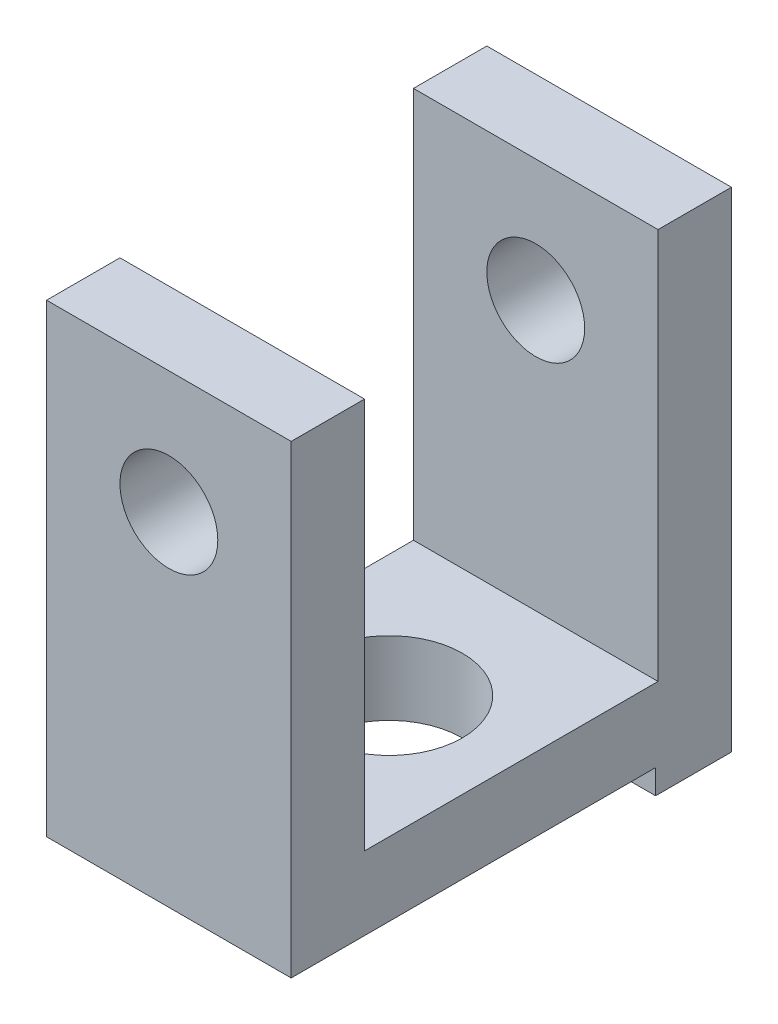
ISO-10303-21;
HEADER;
FILE_DESCRIPTION(('STEP AP214'),'2;1');
FILE_NAME('part.step','',(''),(''),'','','');
FILE_SCHEMA(('AUTOMOTIVE_DESIGN { 1 0 10303 214 1 1 1 1 }'));
ENDSEC;
DATA;
#1=APPLICATION_CONTEXT('core data for automotive mechanical design processes');
#2=APPLICATION_PROTOCOL_DEFINITION('international standard','automotive_design',2000,#1);
#3=PRODUCT_CONTEXT('',#1,'mechanical');
#4=PRODUCT('Part','Part','',(#3));
#5=PRODUCT_RELATED_PRODUCT_CATEGORY('part','',(#4));
#6=PRODUCT_DEFINITION_FORMATION('','',#4);
#7=PRODUCT_DEFINITION_CONTEXT('part definition',#1,'design');
#8=PRODUCT_DEFINITION('design','',#6,#7);
#9=PRODUCT_DEFINITION_SHAPE('','',#8);
#10=(LENGTH_UNIT() NAMED_UNIT(*) SI_UNIT(.MILLI.,.METRE.));
#11=(NAMED_UNIT(*) PLANE_ANGLE_UNIT() SI_UNIT($,.RADIAN.));
#12=(NAMED_UNIT(*) SI_UNIT($,.STERADIAN.) SOLID_ANGLE_UNIT());
#13=UNCERTAINTY_MEASURE_WITH_UNIT(LENGTH_MEASURE(1.E-05),#10,'distance_accuracy_value','');
#14=(GEOMETRIC_REPRESENTATION_CONTEXT(3) GLOBAL_UNCERTAINTY_ASSIGNED_CONTEXT((#13)) GLOBAL_UNIT_ASSIGNED_CONTEXT((#10,
#11,#12)) REPRESENTATION_CONTEXT('',''));
#15=CARTESIAN_POINT('',(0.,0.,0.));
#16=DIRECTION('',(0.,0.,1.));
#17=DIRECTION('',(1.,0.,0.));
#18=AXIS2_PLACEMENT_3D('',#15,#16,#17);
#19=CARTESIAN_POINT('',(0.,4.,9.));
#20=DIRECTION('',(0.,0.,1.));
#21=DIRECTION('',(1.,0.,0.));
#22=AXIS2_PLACEMENT_3D('',#19,#20,#21);
#23=PLANE('',#22);
#24=CARTESIAN_POINT('',(0.,15.,9.));
#25=DIRECTION('',(0.,0.,1.));
#26=DIRECTION('',(1.,0.,0.));
#27=AXIS2_PLACEMENT_3D('',#24,#25,#26);
#28=CIRCLE('',#27,2.);
#29=CARTESIAN_POINT('',(2.,15.,9.));
#30=VERTEX_POINT('',#29);
#31=EDGE_CURVE('E165',#30,#30,#28,.T.);
#32=ORIENTED_EDGE('',*,*,#31,.F.);
#33=EDGE_LOOP('',(#32));
#34=FACE_BOUND('',#33,.T.);
#35=DIRECTION('',(0.,-1.,0.));
#36=VECTOR('',#35,1.);
#37=CARTESIAN_POINT('',(-5.,4.,9.));
#38=LINE('',#37,#36);
#39=CARTESIAN_POINT('',(-5.,20.,9.));
#40=VERTEX_POINT('',#39);
#41=CARTESIAN_POINT('',(-5.,1.,9.));
#42=VERTEX_POINT('',#41);
#43=EDGE_CURVE('E203',#40,#42,#38,.T.);
#44=ORIENTED_EDGE('',*,*,#43,.T.);
#45=DIRECTION('',(-1.,0.,0.));
#46=VECTOR('',#45,1.);
#47=CARTESIAN_POINT('',(-5.,1.,9.));
#48=LINE('',#47,#46);
#49=CARTESIAN_POINT('',(5.,1.,9.));
#50=VERTEX_POINT('',#49);
#51=EDGE_CURVE('E137',#50,#42,#48,.T.);
#52=ORIENTED_EDGE('',*,*,#51,.F.);
#53=DIRECTION('',(0.,-1.,0.));
#54=VECTOR('',#53,1.);
#55=CARTESIAN_POINT('',(5.,4.,9.));
#56=LINE('',#55,#54);
#57=CARTESIAN_POINT('',(5.,20.,9.));
#58=VERTEX_POINT('',#57);
#59=EDGE_CURVE('E136',#58,#50,#56,.T.);
#60=ORIENTED_EDGE('',*,*,#59,.F.);
#61=DIRECTION('',(1.,0.,0.));
#62=VECTOR('',#61,1.);
#63=CARTESIAN_POINT('',(5.,20.,9.));
#64=LINE('',#63,#62);
#65=EDGE_CURVE('E169',#40,#58,#64,.T.);
#66=ORIENTED_EDGE('',*,*,#65,.F.);
#67=EDGE_LOOP('',(#44,#52,#60,#66));
#68=FACE_BOUND('',#67,.T.);
#69=ADVANCED_FACE('F40',(#34,#68),#23,.T.);
#70=CARTESIAN_POINT('',(0.,4.,0.));
#71=DIRECTION('',(0.,-1.,0.));
#72=DIRECTION('',(0.,0.,-1.));
#73=AXIS2_PLACEMENT_3D('',#70,#71,#72);
#74=CYLINDRICAL_SURFACE('',#73,3.);
#75=CARTESIAN_POINT('',(0.,4.,0.));
#76=DIRECTION('',(0.,1.,0.));
#77=DIRECTION('',(0.,0.,1.));
#78=AXIS2_PLACEMENT_3D('',#75,#76,#77);
#79=CIRCLE('',#78,3.);
#80=CARTESIAN_POINT('',(0.,4.,3.));
#81=VERTEX_POINT('',#80);
#82=EDGE_CURVE('E194',#81,#81,#79,.T.);
#83=ORIENTED_EDGE('',*,*,#82,.T.);
#84=EDGE_LOOP('',(#83));
#85=FACE_BOUND('',#84,.T.);
#86=CARTESIAN_POINT('',(0.,1.,0.));
#87=DIRECTION('',(0.,-1.,0.));
#88=DIRECTION('',(0.,0.,-1.));
#89=AXIS2_PLACEMENT_3D('',#86,#87,#88);
#90=CIRCLE('',#89,3.);
#91=CARTESIAN_POINT('',(0.,1.,-3.));
#92=VERTEX_POINT('',#91);
#93=EDGE_CURVE('E44',#92,#92,#90,.T.);
#94=ORIENTED_EDGE('',*,*,#93,.T.);
#95=EDGE_LOOP('',(#94));
#96=FACE_BOUND('',#95,.T.);
#97=ADVANCED_FACE('F252',(#85,#96),#74,.F.);
#98=CARTESIAN_POINT('',(5.,4.,0.));
#99=DIRECTION('',(1.,0.,0.));
#100=DIRECTION('',(0.,0.,-1.));
#101=AXIS2_PLACEMENT_3D('',#98,#99,#100);
#102=PLANE('',#101);
#103=DIRECTION('',(0.,-1.,0.));
#104=VECTOR('',#103,1.);
#105=CARTESIAN_POINT('',(5.,1.,-5.9));
#106=LINE('',#105,#104);
#107=CARTESIAN_POINT('',(5.,1.,-5.9));
#108=VERTEX_POINT('',#107);
#109=CARTESIAN_POINT('',(5.,0.,-5.9));
#110=VERTEX_POINT('',#109);
#111=EDGE_CURVE('E116',#108,#110,#106,.T.);
#112=ORIENTED_EDGE('',*,*,#111,.T.);
#113=DIRECTION('',(0.,0.,1.));
#114=VECTOR('',#113,1.);
#115=CARTESIAN_POINT('',(5.,0.,0.));
#116=LINE('',#115,#114);
#117=CARTESIAN_POINT('',(5.,0.,-9.));
#118=VERTEX_POINT('',#117);
#119=EDGE_CURVE('E188',#118,#110,#116,.T.);
#120=ORIENTED_EDGE('',*,*,#119,.F.);
#121=DIRECTION('',(0.,-1.,0.));
#122=VECTOR('',#121,1.);
#123=CARTESIAN_POINT('',(5.,4.,-9.));
#124=LINE('',#123,#122);
#125=CARTESIAN_POINT('',(5.,20.,-9.));
#126=VERTEX_POINT('',#125);
#127=EDGE_CURVE('E11',#126,#118,#124,.T.);
#128=ORIENTED_EDGE('',*,*,#127,.F.);
#129=DIRECTION('',(0.,0.,1.));
#130=VECTOR('',#129,1.);
#131=CARTESIAN_POINT('',(5.,20.,-6.));
#132=LINE('',#131,#130);
#133=CARTESIAN_POINT('',(5.,20.,-6.));
#134=VERTEX_POINT('',#133);
#135=EDGE_CURVE('E157',#126,#134,#132,.T.);
#136=ORIENTED_EDGE('',*,*,#135,.T.);
#137=DIRECTION('',(0.,-1.,0.));
#138=VECTOR('',#137,1.);
#139=CARTESIAN_POINT('',(5.,20.,-6.));
#140=LINE('',#139,#138);
#141=CARTESIAN_POINT('',(5.,4.,-6.));
#142=VERTEX_POINT('',#141);
#143=EDGE_CURVE('E160',#134,#142,#140,.T.);
#144=ORIENTED_EDGE('',*,*,#143,.T.);
#145=DIRECTION('',(0.,0.,1.));
#146=VECTOR('',#145,1.);
#147=CARTESIAN_POINT('',(5.,4.,0.));
#148=LINE('',#147,#146);
#149=CARTESIAN_POINT('',(5.,4.,6.));
#150=VERTEX_POINT('',#149);
#151=EDGE_CURVE('E189',#142,#150,#148,.T.);
#152=ORIENTED_EDGE('',*,*,#151,.T.);
#153=DIRECTION('',(0.,-1.,0.));
#154=VECTOR('',#153,1.);
#155=CARTESIAN_POINT('',(5.,20.,6.));
#156=LINE('',#155,#154);
#157=CARTESIAN_POINT('',(5.,20.,6.));
#158=VERTEX_POINT('',#157);
#159=EDGE_CURVE('E185',#158,#150,#156,.T.);
#160=ORIENTED_EDGE('',*,*,#159,.F.);
#161=DIRECTION('',(0.,0.,-1.));
#162=VECTOR('',#161,1.);
#163=CARTESIAN_POINT('',(5.,20.,6.));
#164=LINE('',#163,#162);
#165=EDGE_CURVE('E172',#58,#158,#164,.T.);
#166=ORIENTED_EDGE('',*,*,#165,.F.);
#167=ORIENTED_EDGE('',*,*,#59,.T.);
#168=DIRECTION('',(0.,0.,1.));
#169=VECTOR('',#168,1.);
#170=CARTESIAN_POINT('',(5.,1.,-5.9));
#171=LINE('',#170,#169);
#172=EDGE_CURVE('E130',#108,#50,#171,.T.);
#173=ORIENTED_EDGE('',*,*,#172,.F.);
#174=EDGE_LOOP('',(#112,#120,#128,#136,#144,#152,#160,#166,#167,#173));
#175=FACE_BOUND('',#174,.T.);
#176=ADVANCED_FACE('F42',(#175),#102,.T.);
#177=CARTESIAN_POINT('',(0.,4.,-9.));
#178=DIRECTION('',(0.,0.,1.));
#179=DIRECTION('',(1.,0.,0.));
#180=AXIS2_PLACEMENT_3D('',#177,#178,#179);
#181=PLANE('',#180);
#182=CARTESIAN_POINT('',(0.,15.,-9.));
#183=DIRECTION('',(0.,0.,1.));
#184=DIRECTION('',(1.,0.,0.));
#185=AXIS2_PLACEMENT_3D('',#182,#183,#184);
#186=CIRCLE('',#185,2.);
#187=CARTESIAN_POINT('',(2.,15.,-9.));
#188=VERTEX_POINT('',#187);
#189=EDGE_CURVE('E144',#188,#188,#186,.T.);
#190=ORIENTED_EDGE('',*,*,#189,.T.);
#191=EDGE_LOOP('',(#190));
#192=FACE_BOUND('',#191,.T.);
#193=DIRECTION('',(-1.,0.,0.));
#194=VECTOR('',#193,1.);
#195=CARTESIAN_POINT('',(0.,0.,-9.));
#196=LINE('',#195,#194);
#197=CARTESIAN_POINT('',(-5.,0.,-9.));
#198=VERTEX_POINT('',#197);
#199=EDGE_CURVE('E198',#118,#198,#196,.T.);
#200=ORIENTED_EDGE('',*,*,#199,.T.);
#201=DIRECTION('',(0.,-1.,0.));
#202=VECTOR('',#201,1.);
#203=CARTESIAN_POINT('',(-5.,4.,-9.));
#204=LINE('',#203,#202);
#205=CARTESIAN_POINT('',(-5.,20.,-9.));
#206=VERTEX_POINT('',#205);
#207=EDGE_CURVE('E49',#206,#198,#204,.T.);
#208=ORIENTED_EDGE('',*,*,#207,.F.);
#209=DIRECTION('',(1.,0.,0.));
#210=VECTOR('',#209,1.);
#211=CARTESIAN_POINT('',(5.,20.,-9.));
#212=LINE('',#211,#210);
#213=EDGE_CURVE('E148',#206,#126,#212,.T.);
#214=ORIENTED_EDGE('',*,*,#213,.T.);
#215=ORIENTED_EDGE('',*,*,#127,.T.);
#216=EDGE_LOOP('',(#200,#208,#214,#215));
#217=FACE_BOUND('',#216,.T.);
#218=ADVANCED_FACE('F221',(#192,#217),#181,.F.);
#219=CARTESIAN_POINT('',(-5.,4.,0.));
#220=DIRECTION('',(1.,0.,0.));
#221=DIRECTION('',(0.,0.,-1.));
#222=AXIS2_PLACEMENT_3D('',#219,#220,#221);
#223=PLANE('',#222);
#224=DIRECTION('',(0.,0.,1.));
#225=VECTOR('',#224,1.);
#226=CARTESIAN_POINT('',(-5.,0.,0.));
#227=LINE('',#226,#225);
#228=CARTESIAN_POINT('',(-5.,0.,-5.9));
#229=VERTEX_POINT('',#228);
#230=EDGE_CURVE('E192',#198,#229,#227,.T.);
#231=ORIENTED_EDGE('',*,*,#230,.T.);
#232=DIRECTION('',(0.,-1.,0.));
#233=VECTOR('',#232,1.);
#234=CARTESIAN_POINT('',(-5.,1.,-5.9));
#235=LINE('',#234,#233);
#236=CARTESIAN_POINT('',(-5.,1.,-5.9));
#237=VERTEX_POINT('',#236);
#238=EDGE_CURVE('E57',#237,#229,#235,.T.);
#239=ORIENTED_EDGE('',*,*,#238,.F.);
#240=DIRECTION('',(0.,0.,-1.));
#241=VECTOR('',#240,1.);
#242=CARTESIAN_POINT('',(-5.,1.,9.));
#243=LINE('',#242,#241);
#244=EDGE_CURVE('E126',#42,#237,#243,.T.);
#245=ORIENTED_EDGE('',*,*,#244,.F.);
#246=ORIENTED_EDGE('',*,*,#43,.F.);
#247=DIRECTION('',(0.,0.,1.));
#248=VECTOR('',#247,1.);
#249=CARTESIAN_POINT('',(-5.,20.,9.));
#250=LINE('',#249,#248);
#251=CARTESIAN_POINT('',(-5.,20.,6.));
#252=VERTEX_POINT('',#251);
#253=EDGE_CURVE('E177',#252,#40,#250,.T.);
#254=ORIENTED_EDGE('',*,*,#253,.F.);
#255=DIRECTION('',(0.,-1.,0.));
#256=VECTOR('',#255,1.);
#257=CARTESIAN_POINT('',(-5.,20.,6.));
#258=LINE('',#257,#256);
#259=CARTESIAN_POINT('',(-5.,4.,6.));
#260=VERTEX_POINT('',#259);
#261=EDGE_CURVE('E180',#252,#260,#258,.T.);
#262=ORIENTED_EDGE('',*,*,#261,.T.);
#263=DIRECTION('',(0.,0.,1.));
#264=VECTOR('',#263,1.);
#265=CARTESIAN_POINT('',(-5.,4.,0.));
#266=LINE('',#265,#264);
#267=CARTESIAN_POINT('',(-5.,4.,-6.));
#268=VERTEX_POINT('',#267);
#269=EDGE_CURVE('E191',#268,#260,#266,.T.);
#270=ORIENTED_EDGE('',*,*,#269,.F.);
#271=DIRECTION('',(0.,-1.,0.));
#272=VECTOR('',#271,1.);
#273=CARTESIAN_POINT('',(-5.,20.,-6.));
#274=LINE('',#273,#272);
#275=CARTESIAN_POINT('',(-5.,20.,-6.));
#276=VERTEX_POINT('',#275);
#277=EDGE_CURVE('E163',#276,#268,#274,.T.);
#278=ORIENTED_EDGE('',*,*,#277,.F.);
#279=DIRECTION('',(0.,0.,-1.));
#280=VECTOR('',#279,1.);
#281=CARTESIAN_POINT('',(-5.,20.,-9.));
#282=LINE('',#281,#280);
#283=EDGE_CURVE('E151',#276,#206,#282,.T.);
#284=ORIENTED_EDGE('',*,*,#283,.T.);
#285=ORIENTED_EDGE('',*,*,#207,.T.);
#286=EDGE_LOOP('',(#231,#239,#245,#246,#254,#262,#270,#278,#284,#285));
#287=FACE_BOUND('',#286,.T.);
#288=ADVANCED_FACE('F224',(#287),#223,.F.);
#289=CARTESIAN_POINT('',(0.,4.,0.));
#290=DIRECTION('',(0.,1.,0.));
#291=DIRECTION('',(0.,0.,1.));
#292=AXIS2_PLACEMENT_3D('',#289,#290,#291);
#293=PLANE('',#292);
#294=DIRECTION('',(-1.,0.,0.));
#295=VECTOR('',#294,1.);
#296=CARTESIAN_POINT('',(-5.,4.,-6.));
#297=LINE('',#296,#295);
#298=EDGE_CURVE('E65',#142,#268,#297,.T.);
#299=ORIENTED_EDGE('',*,*,#298,.T.);
#300=ORIENTED_EDGE('',*,*,#269,.T.);
#301=DIRECTION('',(-1.,0.,0.));
#302=VECTOR('',#301,1.);
#303=CARTESIAN_POINT('',(-5.,4.,6.));
#304=LINE('',#303,#302);
#305=EDGE_CURVE('E173',#150,#260,#304,.T.);
#306=ORIENTED_EDGE('',*,*,#305,.F.);
#307=ORIENTED_EDGE('',*,*,#151,.F.);
#308=EDGE_LOOP('',(#299,#300,#306,#307));
#309=FACE_BOUND('',#308,.T.);
#310=ORIENTED_EDGE('',*,*,#82,.F.);
#311=EDGE_LOOP('',(#310));
#312=FACE_BOUND('',#311,.T.);
#313=ADVANCED_FACE('F239',(#309,#312),#293,.T.);
#314=CARTESIAN_POINT('',(0.,0.,0.));
#315=DIRECTION('',(0.,1.,0.));
#316=DIRECTION('',(0.,0.,1.));
#317=AXIS2_PLACEMENT_3D('',#314,#315,#316);
#318=PLANE('',#317);
#319=ORIENTED_EDGE('',*,*,#119,.T.);
#320=DIRECTION('',(1.,0.,0.));
#321=VECTOR('',#320,1.);
#322=CARTESIAN_POINT('',(-5.,0.,-5.9));
#323=LINE('',#322,#321);
#324=EDGE_CURVE('E121',#229,#110,#323,.T.);
#325=ORIENTED_EDGE('',*,*,#324,.F.);
#326=ORIENTED_EDGE('',*,*,#230,.F.);
#327=ORIENTED_EDGE('',*,*,#199,.F.);
#328=EDGE_LOOP('',(#319,#325,#326,#327));
#329=FACE_BOUND('',#328,.T.);
#330=ADVANCED_FACE('F231',(#329),#318,.F.);
#331=CARTESIAN_POINT('',(-5.,20.,6.));
#332=DIRECTION('',(0.,0.,1.));
#333=DIRECTION('',(1.,0.,0.));
#334=AXIS2_PLACEMENT_3D('',#331,#332,#333);
#335=PLANE('',#334);
#336=CARTESIAN_POINT('',(0.,15.,6.));
#337=DIRECTION('',(0.,0.,1.));
#338=DIRECTION('',(1.,0.,0.));
#339=AXIS2_PLACEMENT_3D('',#336,#337,#338);
#340=CIRCLE('',#339,2.);
#341=CARTESIAN_POINT('',(2.,15.,6.));
#342=VERTEX_POINT('',#341);
#343=EDGE_CURVE('E168',#342,#342,#340,.T.);
#344=ORIENTED_EDGE('',*,*,#343,.T.);
#345=EDGE_LOOP('',(#344));
#346=FACE_BOUND('',#345,.T.);
#347=ORIENTED_EDGE('',*,*,#305,.T.);
#348=ORIENTED_EDGE('',*,*,#261,.F.);
#349=DIRECTION('',(-1.,0.,0.));
#350=VECTOR('',#349,1.);
#351=CARTESIAN_POINT('',(-5.,20.,6.));
#352=LINE('',#351,#350);
#353=EDGE_CURVE('E175',#158,#252,#352,.T.);
#354=ORIENTED_EDGE('',*,*,#353,.F.);
#355=ORIENTED_EDGE('',*,*,#159,.T.);
#356=EDGE_LOOP('',(#347,#348,#354,#355));
#357=FACE_BOUND('',#356,.T.);
#358=ADVANCED_FACE('F245',(#346,#357),#335,.F.);
#359=CARTESIAN_POINT('',(0.,20.,0.));
#360=DIRECTION('',(0.,-1.,0.));
#361=DIRECTION('',(0.,0.,-1.));
#362=AXIS2_PLACEMENT_3D('',#359,#360,#361);
#363=PLANE('',#362);
#364=ORIENTED_EDGE('',*,*,#65,.T.);
#365=ORIENTED_EDGE('',*,*,#165,.T.);
#366=ORIENTED_EDGE('',*,*,#353,.T.);
#367=ORIENTED_EDGE('',*,*,#253,.T.);
#368=EDGE_LOOP('',(#364,#365,#366,#367));
#369=FACE_BOUND('',#368,.T.);
#370=ADVANCED_FACE('F248',(#369),#363,.F.);
#371=CARTESIAN_POINT('',(0.,15.,-9.));
#372=DIRECTION('',(0.,0.,1.));
#373=DIRECTION('',(1.,0.,0.));
#374=AXIS2_PLACEMENT_3D('',#371,#372,#373);
#375=CYLINDRICAL_SURFACE('',#374,2.);
#376=ORIENTED_EDGE('',*,*,#31,.T.);
#377=EDGE_LOOP('',(#376));
#378=FACE_BOUND('',#377,.T.);
#379=ORIENTED_EDGE('',*,*,#343,.F.);
#380=EDGE_LOOP('',(#379));
#381=FACE_BOUND('',#380,.T.);
#382=ADVANCED_FACE('F277',(#378,#381),#375,.F.);
#383=CARTESIAN_POINT('',(-5.,20.,-6.));
#384=DIRECTION('',(0.,0.,1.));
#385=DIRECTION('',(1.,0.,0.));
#386=AXIS2_PLACEMENT_3D('',#383,#384,#385);
#387=PLANE('',#386);
#388=CARTESIAN_POINT('',(0.,15.,-6.));
#389=DIRECTION('',(0.,0.,1.));
#390=DIRECTION('',(1.,0.,0.));
#391=AXIS2_PLACEMENT_3D('',#388,#389,#390);
#392=CIRCLE('',#391,2.);
#393=CARTESIAN_POINT('',(2.,15.,-6.));
#394=VERTEX_POINT('',#393);
#395=EDGE_CURVE('E147',#394,#394,#392,.F.);
#396=ORIENTED_EDGE('',*,*,#395,.T.);
#397=EDGE_LOOP('',(#396));
#398=FACE_BOUND('',#397,.T.);
#399=ORIENTED_EDGE('',*,*,#298,.F.);
#400=ORIENTED_EDGE('',*,*,#143,.F.);
#401=DIRECTION('',(-1.,0.,0.));
#402=VECTOR('',#401,1.);
#403=CARTESIAN_POINT('',(-5.,20.,-6.));
#404=LINE('',#403,#402);
#405=EDGE_CURVE('E154',#134,#276,#404,.T.);
#406=ORIENTED_EDGE('',*,*,#405,.T.);
#407=ORIENTED_EDGE('',*,*,#277,.T.);
#408=EDGE_LOOP('',(#399,#400,#406,#407));
#409=FACE_BOUND('',#408,.T.);
#410=ADVANCED_FACE('F212',(#398,#409),#387,.T.);
#411=CARTESIAN_POINT('',(0.,20.,0.));
#412=DIRECTION('',(0.,-1.,0.));
#413=DIRECTION('',(0.,0.,1.));
#414=AXIS2_PLACEMENT_3D('',#411,#412,#413);
#415=PLANE('',#414);
#416=ORIENTED_EDGE('',*,*,#213,.F.);
#417=ORIENTED_EDGE('',*,*,#283,.F.);
#418=ORIENTED_EDGE('',*,*,#405,.F.);
#419=ORIENTED_EDGE('',*,*,#135,.F.);
#420=EDGE_LOOP('',(#416,#417,#418,#419));
#421=FACE_BOUND('',#420,.T.);
#422=ADVANCED_FACE('F217',(#421),#415,.F.);
#423=CARTESIAN_POINT('',(0.,15.,9.));
#424=DIRECTION('',(0.,0.,-1.));
#425=DIRECTION('',(-1.,0.,0.));
#426=AXIS2_PLACEMENT_3D('',#423,#424,#425);
#427=CYLINDRICAL_SURFACE('',#426,2.);
#428=ORIENTED_EDGE('',*,*,#395,.F.);
#429=EDGE_LOOP('',(#428));
#430=FACE_BOUND('',#429,.T.);
#431=ORIENTED_EDGE('',*,*,#189,.F.);
#432=EDGE_LOOP('',(#431));
#433=FACE_BOUND('',#432,.T.);
#434=ADVANCED_FACE('F214',(#430,#433),#427,.F.);
#435=CARTESIAN_POINT('',(-5.,1.,-5.9));
#436=DIRECTION('',(0.,0.,-1.));
#437=DIRECTION('',(-1.,0.,0.));
#438=AXIS2_PLACEMENT_3D('',#435,#436,#437);
#439=PLANE('',#438);
#440=ORIENTED_EDGE('',*,*,#324,.T.);
#441=ORIENTED_EDGE('',*,*,#111,.F.);
#442=DIRECTION('',(1.,0.,0.));
#443=VECTOR('',#442,1.);
#444=CARTESIAN_POINT('',(-5.,1.,-5.9));
#445=LINE('',#444,#443);
#446=EDGE_CURVE('E119',#237,#108,#445,.T.);
#447=ORIENTED_EDGE('',*,*,#446,.F.);
#448=ORIENTED_EDGE('',*,*,#238,.T.);
#449=EDGE_LOOP('',(#440,#441,#447,#448));
#450=FACE_BOUND('',#449,.T.);
#451=ADVANCED_FACE('F118',(#450),#439,.F.);
#452=CARTESIAN_POINT('',(0.,1.,0.));
#453=DIRECTION('',(0.,-1.,0.));
#454=DIRECTION('',(0.,0.,-1.));
#455=AXIS2_PLACEMENT_3D('',#452,#453,#454);
#456=PLANE('',#455);
#457=ORIENTED_EDGE('',*,*,#93,.F.);
#458=EDGE_LOOP('',(#457));
#459=FACE_BOUND('',#458,.T.);
#460=ORIENTED_EDGE('',*,*,#446,.T.);
#461=ORIENTED_EDGE('',*,*,#172,.T.);
#462=ORIENTED_EDGE('',*,*,#51,.T.);
#463=ORIENTED_EDGE('',*,*,#244,.T.);
#464=EDGE_LOOP('',(#460,#461,#462,#463));
#465=FACE_BOUND('',#464,.T.);
#466=ADVANCED_FACE('F129',(#459,#465),#456,.T.);
#467=CLOSED_SHELL('',(#69,#97,#176,#218,#288,#313,#330,#358,#370,#382,#410,#422,#434,#451,#466));
#468=MANIFOLD_SOLID_BREP('B2',#467);
#469=ADVANCED_BREP_SHAPE_REPRESENTATION('',(#18,#468),#14);
#470=SHAPE_DEFINITION_REPRESENTATION(#9,#469);
ENDSEC;
END-ISO-10303-21;
